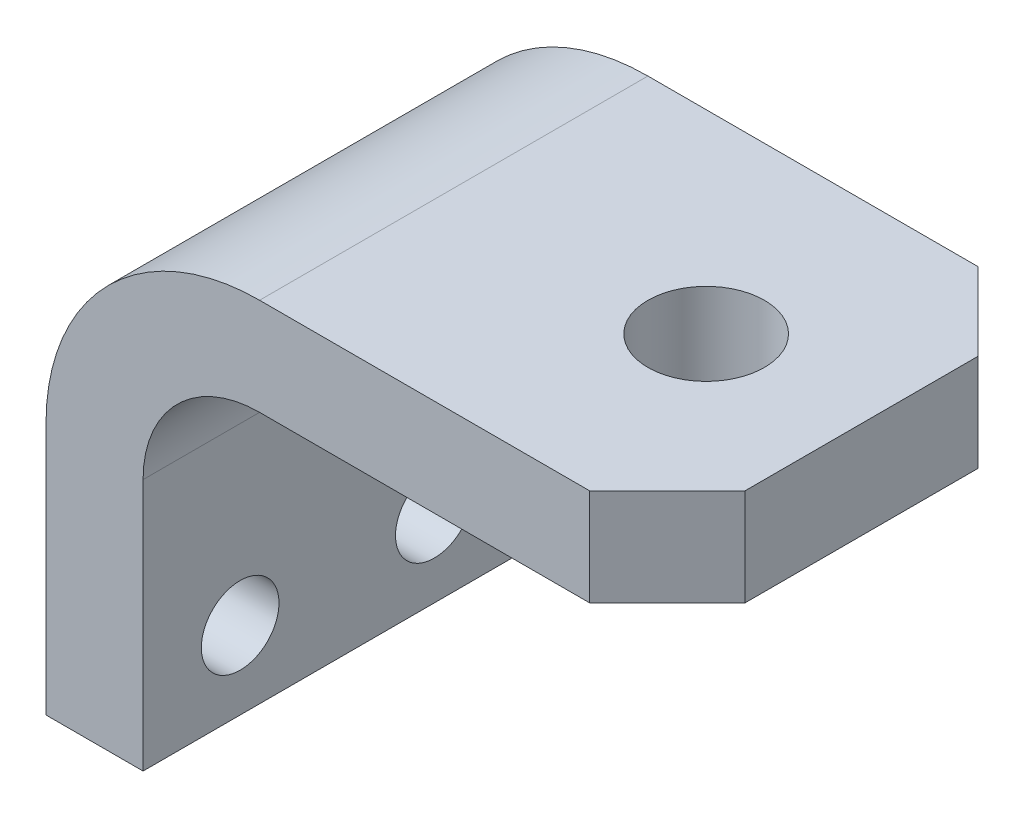
ISO-10303-21;
HEADER;
FILE_DESCRIPTION(('STEP AP214'),'2;1');
FILE_NAME('part.step','',(''),(''),'','','');
FILE_SCHEMA(('AUTOMOTIVE_DESIGN { 1 0 10303 214 1 1 1 1 }'));
ENDSEC;
DATA;
#1=APPLICATION_CONTEXT('core data for automotive mechanical design processes');
#2=APPLICATION_PROTOCOL_DEFINITION('international standard','automotive_design',2000,#1);
#3=PRODUCT_CONTEXT('',#1,'mechanical');
#4=PRODUCT('Part','Part','',(#3));
#5=PRODUCT_RELATED_PRODUCT_CATEGORY('part','',(#4));
#6=PRODUCT_DEFINITION_FORMATION('','',#4);
#7=PRODUCT_DEFINITION_CONTEXT('part definition',#1,'design');
#8=PRODUCT_DEFINITION('design','',#6,#7);
#9=PRODUCT_DEFINITION_SHAPE('','',#8);
#10=(LENGTH_UNIT() NAMED_UNIT(*) SI_UNIT(.MILLI.,.METRE.));
#11=(NAMED_UNIT(*) PLANE_ANGLE_UNIT() SI_UNIT($,.RADIAN.));
#12=(NAMED_UNIT(*) SI_UNIT($,.STERADIAN.) SOLID_ANGLE_UNIT());
#13=UNCERTAINTY_MEASURE_WITH_UNIT(LENGTH_MEASURE(1.E-05),#10,'distance_accuracy_value','');
#14=(GEOMETRIC_REPRESENTATION_CONTEXT(3) GLOBAL_UNCERTAINTY_ASSIGNED_CONTEXT((#13)) GLOBAL_UNIT_ASSIGNED_CONTEXT((#10,
#11,#12)) REPRESENTATION_CONTEXT('',''));
#15=CARTESIAN_POINT('',(0.,0.,0.));
#16=DIRECTION('',(0.,0.,1.));
#17=DIRECTION('',(1.,0.,0.));
#18=AXIS2_PLACEMENT_3D('',#15,#16,#17);
#19=CARTESIAN_POINT('',(25.4,0.,31.75));
#20=DIRECTION('',(-1.,0.,0.));
#21=DIRECTION('',(0.,-1.,0.));
#22=AXIS2_PLACEMENT_3D('',#19,#20,#21);
#23=PLANE('',#22);
#24=DIRECTION('',(0.,0.,-1.));
#25=VECTOR('',#24,1.);
#26=CARTESIAN_POINT('',(25.4,15.875,31.75));
#27=LINE('',#26,#25);
#28=CARTESIAN_POINT('',(25.4,15.875,19.0500000000001));
#29=VERTEX_POINT('',#28);
#30=CARTESIAN_POINT('',(25.4,15.875,-19.0500000000001));
#31=VERTEX_POINT('',#30);
#32=EDGE_CURVE('E120',#29,#31,#27,.T.);
#33=ORIENTED_EDGE('',*,*,#32,.F.);
#34=DIRECTION('',(0.,1.,0.));
#35=VECTOR('',#34,1.);
#36=CARTESIAN_POINT('',(25.4,-60.325,19.0500000000001));
#37=LINE('',#36,#35);
#38=CARTESIAN_POINT('',(25.4,0.,19.0500000000001));
#39=VERTEX_POINT('',#38);
#40=EDGE_CURVE('E108',#39,#29,#37,.T.);
#41=ORIENTED_EDGE('',*,*,#40,.F.);
#42=DIRECTION('',(0.,0.,-1.));
#43=VECTOR('',#42,1.);
#44=CARTESIAN_POINT('',(25.4,0.,31.75));
#45=LINE('',#44,#43);
#46=CARTESIAN_POINT('',(25.4,0.,-19.0500000000001));
#47=VERTEX_POINT('',#46);
#48=EDGE_CURVE('E164',#39,#47,#45,.T.);
#49=ORIENTED_EDGE('',*,*,#48,.T.);
#50=DIRECTION('',(0.,1.,0.));
#51=VECTOR('',#50,1.);
#52=CARTESIAN_POINT('',(25.4,-60.325,-19.0500000000001));
#53=LINE('',#52,#51);
#54=EDGE_CURVE('E127',#47,#31,#53,.T.);
#55=ORIENTED_EDGE('',*,*,#54,.T.);
#56=EDGE_LOOP('',(#33,#41,#49,#55));
#57=FACE_BOUND('',#56,.T.);
#58=ADVANCED_FACE('F34',(#57),#23,.F.);
#59=CARTESIAN_POINT('',(25.4,15.875,31.75));
#60=DIRECTION('',(0.,-1.,0.));
#61=DIRECTION('',(1.,0.,0.));
#62=AXIS2_PLACEMENT_3D('',#59,#60,#61);
#63=PLANE('',#62);
#64=CARTESIAN_POINT('',(0.,15.875,0.));
#65=DIRECTION('',(0.,1.,0.));
#66=DIRECTION('',(-1.,0.,0.));
#67=AXIS2_PLACEMENT_3D('',#64,#65,#66);
#68=CIRCLE('',#67,9.525);
#69=CARTESIAN_POINT('',(-9.525,15.875,0.));
#70=VERTEX_POINT('',#69);
#71=EDGE_CURVE('E138',#70,#70,#68,.T.);
#72=ORIENTED_EDGE('',*,*,#71,.F.);
#73=EDGE_LOOP('',(#72));
#74=FACE_BOUND('',#73,.T.);
#75=DIRECTION('',(-1.,0.,0.));
#76=VECTOR('',#75,1.);
#77=CARTESIAN_POINT('',(25.4,15.875,31.75));
#78=LINE('',#77,#76);
#79=CARTESIAN_POINT('',(12.7,15.875,31.75));
#80=VERTEX_POINT('',#79);
#81=CARTESIAN_POINT('',(-41.275,15.875,31.75));
#82=VERTEX_POINT('',#81);
#83=EDGE_CURVE('E123',#80,#82,#78,.T.);
#84=ORIENTED_EDGE('',*,*,#83,.F.);
#85=DIRECTION('',(-0.707106781186551,0.,0.707106781186544));
#86=VECTOR('',#85,1.);
#87=CARTESIAN_POINT('',(12.7,15.875,31.75));
#88=LINE('',#87,#86);
#89=EDGE_CURVE('E47',#29,#80,#88,.T.);
#90=ORIENTED_EDGE('',*,*,#89,.F.);
#91=ORIENTED_EDGE('',*,*,#32,.T.);
#92=DIRECTION('',(0.707106781186551,0.,0.707106781186544));
#93=VECTOR('',#92,1.);
#94=CARTESIAN_POINT('',(12.7,15.875,-31.75));
#95=LINE('',#94,#93);
#96=CARTESIAN_POINT('',(12.7,15.875,-31.75));
#97=VERTEX_POINT('',#96);
#98=EDGE_CURVE('E218',#97,#31,#95,.T.);
#99=ORIENTED_EDGE('',*,*,#98,.F.);
#100=DIRECTION('',(-1.,0.,0.));
#101=VECTOR('',#100,1.);
#102=CARTESIAN_POINT('',(25.4,15.875,-31.75));
#103=LINE('',#102,#101);
#104=CARTESIAN_POINT('',(-41.275,15.875,-31.75));
#105=VERTEX_POINT('',#104);
#106=EDGE_CURVE('E137',#97,#105,#103,.T.);
#107=ORIENTED_EDGE('',*,*,#106,.T.);
#108=DIRECTION('',(0.,0.,-1.));
#109=VECTOR('',#108,1.);
#110=CARTESIAN_POINT('',(-41.275,15.875,31.75));
#111=LINE('',#110,#109);
#112=EDGE_CURVE('E128',#82,#105,#111,.T.);
#113=ORIENTED_EDGE('',*,*,#112,.F.);
#114=EDGE_LOOP('',(#84,#90,#91,#99,#107,#113));
#115=FACE_BOUND('',#114,.T.);
#116=ADVANCED_FACE('F118',(#74,#115),#63,.F.);
#117=CARTESIAN_POINT('',(-41.275,-19.05,31.75));
#118=DIRECTION('',(0.,0.,-1.));
#119=DIRECTION('',(-1.,0.,0.));
#120=AXIS2_PLACEMENT_3D('',#117,#118,#119);
#121=CYLINDRICAL_SURFACE('',#120,34.925);
#122=CARTESIAN_POINT('',(-41.275,-19.05,-31.75));
#123=DIRECTION('',(0.,0.,1.));
#124=DIRECTION('',(1.,0.,0.));
#125=AXIS2_PLACEMENT_3D('',#122,#123,#124);
#126=CIRCLE('',#125,34.925);
#127=CARTESIAN_POINT('',(-76.2,-19.05,-31.75));
#128=VERTEX_POINT('',#127);
#129=EDGE_CURVE('E141',#105,#128,#126,.T.);
#130=ORIENTED_EDGE('',*,*,#129,.T.);
#131=DIRECTION('',(0.,0.,-1.));
#132=VECTOR('',#131,1.);
#133=CARTESIAN_POINT('',(-76.2,-19.05,31.75));
#134=LINE('',#133,#132);
#135=CARTESIAN_POINT('',(-76.2,-19.05,31.75));
#136=VERTEX_POINT('',#135);
#137=EDGE_CURVE('E131',#136,#128,#134,.T.);
#138=ORIENTED_EDGE('',*,*,#137,.F.);
#139=CARTESIAN_POINT('',(-41.275,-19.05,31.75));
#140=DIRECTION('',(0.,0.,1.));
#141=DIRECTION('',(1.,0.,0.));
#142=AXIS2_PLACEMENT_3D('',#139,#140,#141);
#143=CIRCLE('',#142,34.925);
#144=EDGE_CURVE('E151',#82,#136,#143,.T.);
#145=ORIENTED_EDGE('',*,*,#144,.F.);
#146=ORIENTED_EDGE('',*,*,#112,.T.);
#147=EDGE_LOOP('',(#130,#138,#145,#146));
#148=FACE_BOUND('',#147,.T.);
#149=ADVANCED_FACE('F217',(#148),#121,.T.);
#150=CARTESIAN_POINT('',(-76.2,-60.325,31.75));
#151=DIRECTION('',(1.,0.,0.));
#152=DIRECTION('',(0.,0.,-1.));
#153=AXIS2_PLACEMENT_3D('',#150,#151,#152);
#154=PLANE('',#153);
#155=CARTESIAN_POINT('',(-76.2,-47.625,-15.875));
#156=DIRECTION('',(1.,0.,0.));
#157=DIRECTION('',(0.,0.,-1.));
#158=AXIS2_PLACEMENT_3D('',#155,#156,#157);
#159=CIRCLE('',#158,6.35);
#160=CARTESIAN_POINT('',(-76.2,-47.625,-22.225));
#161=VERTEX_POINT('',#160);
#162=EDGE_CURVE('E359',#161,#161,#159,.F.);
#163=ORIENTED_EDGE('',*,*,#162,.F.);
#164=EDGE_LOOP('',(#163));
#165=FACE_BOUND('',#164,.T.);
#166=CARTESIAN_POINT('',(-76.2,-47.625,15.875));
#167=DIRECTION('',(1.,0.,0.));
#168=DIRECTION('',(0.,0.,-1.));
#169=AXIS2_PLACEMENT_3D('',#166,#167,#168);
#170=CIRCLE('',#169,6.35);
#171=CARTESIAN_POINT('',(-76.2,-47.625,9.525));
#172=VERTEX_POINT('',#171);
#173=EDGE_CURVE('E124',#172,#172,#170,.F.);
#174=ORIENTED_EDGE('',*,*,#173,.F.);
#175=EDGE_LOOP('',(#174));
#176=FACE_BOUND('',#175,.T.);
#177=DIRECTION('',(0.,-1.,0.));
#178=VECTOR('',#177,1.);
#179=CARTESIAN_POINT('',(-76.2,-60.325,-31.75));
#180=LINE('',#179,#178);
#181=CARTESIAN_POINT('',(-76.2,-60.325,-31.75));
#182=VERTEX_POINT('',#181);
#183=EDGE_CURVE('E167',#128,#182,#180,.T.);
#184=ORIENTED_EDGE('',*,*,#183,.T.);
#185=DIRECTION('',(0.,0.,-1.));
#186=VECTOR('',#185,1.);
#187=CARTESIAN_POINT('',(-76.2,-60.325,31.75));
#188=LINE('',#187,#186);
#189=CARTESIAN_POINT('',(-76.2,-60.325,31.75));
#190=VERTEX_POINT('',#189);
#191=EDGE_CURVE('E187',#190,#182,#188,.T.);
#192=ORIENTED_EDGE('',*,*,#191,.F.);
#193=DIRECTION('',(0.,-1.,0.));
#194=VECTOR('',#193,1.);
#195=CARTESIAN_POINT('',(-76.2,-60.325,31.75));
#196=LINE('',#195,#194);
#197=EDGE_CURVE('E154',#136,#190,#196,.T.);
#198=ORIENTED_EDGE('',*,*,#197,.F.);
#199=ORIENTED_EDGE('',*,*,#137,.T.);
#200=EDGE_LOOP('',(#184,#192,#198,#199));
#201=FACE_BOUND('',#200,.T.);
#202=ADVANCED_FACE('F194',(#165,#176,#201),#154,.F.);
#203=CARTESIAN_POINT('',(-76.2,-60.325,31.75));
#204=DIRECTION('',(0.,1.,0.));
#205=DIRECTION('',(0.,0.,1.));
#206=AXIS2_PLACEMENT_3D('',#203,#204,#205);
#207=PLANE('',#206);
#208=DIRECTION('',(1.,0.,0.));
#209=VECTOR('',#208,1.);
#210=CARTESIAN_POINT('',(-76.2,-60.325,-31.75));
#211=LINE('',#210,#209);
#212=CARTESIAN_POINT('',(-60.325,-60.325,-31.75));
#213=VERTEX_POINT('',#212);
#214=EDGE_CURVE('E169',#182,#213,#211,.T.);
#215=ORIENTED_EDGE('',*,*,#214,.T.);
#216=DIRECTION('',(0.,0.,-1.));
#217=VECTOR('',#216,1.);
#218=CARTESIAN_POINT('',(-60.325,-60.325,31.75));
#219=LINE('',#218,#217);
#220=CARTESIAN_POINT('',(-60.325,-60.325,31.75));
#221=VERTEX_POINT('',#220);
#222=EDGE_CURVE('E184',#221,#213,#219,.T.);
#223=ORIENTED_EDGE('',*,*,#222,.F.);
#224=DIRECTION('',(1.,0.,0.));
#225=VECTOR('',#224,1.);
#226=CARTESIAN_POINT('',(-76.2,-60.325,31.75));
#227=LINE('',#226,#225);
#228=EDGE_CURVE('E156',#190,#221,#227,.T.);
#229=ORIENTED_EDGE('',*,*,#228,.F.);
#230=ORIENTED_EDGE('',*,*,#191,.T.);
#231=EDGE_LOOP('',(#215,#223,#229,#230));
#232=FACE_BOUND('',#231,.T.);
#233=ADVANCED_FACE('F207',(#232),#207,.F.);
#234=CARTESIAN_POINT('',(-60.325,-60.325,31.75));
#235=DIRECTION('',(-1.,0.,0.));
#236=DIRECTION('',(0.,-1.,0.));
#237=AXIS2_PLACEMENT_3D('',#234,#235,#236);
#238=PLANE('',#237);
#239=CARTESIAN_POINT('',(-60.325,-47.625,-15.875));
#240=DIRECTION('',(1.,0.,0.));
#241=DIRECTION('',(0.,1.,0.));
#242=AXIS2_PLACEMENT_3D('',#239,#240,#241);
#243=CIRCLE('',#242,6.35);
#244=CARTESIAN_POINT('',(-60.325,-41.275,-15.875));
#245=VERTEX_POINT('',#244);
#246=EDGE_CURVE('E356',#245,#245,#243,.T.);
#247=ORIENTED_EDGE('',*,*,#246,.F.);
#248=EDGE_LOOP('',(#247));
#249=FACE_BOUND('',#248,.T.);
#250=CARTESIAN_POINT('',(-60.325,-47.625,15.875));
#251=DIRECTION('',(1.,0.,0.));
#252=DIRECTION('',(0.,1.,0.));
#253=AXIS2_PLACEMENT_3D('',#250,#251,#252);
#254=CIRCLE('',#253,6.35);
#255=CARTESIAN_POINT('',(-60.325,-41.275,15.875));
#256=VERTEX_POINT('',#255);
#257=EDGE_CURVE('E360',#256,#256,#254,.T.);
#258=ORIENTED_EDGE('',*,*,#257,.F.);
#259=EDGE_LOOP('',(#258));
#260=FACE_BOUND('',#259,.T.);
#261=DIRECTION('',(0.,1.,0.));
#262=VECTOR('',#261,1.);
#263=CARTESIAN_POINT('',(-60.325,-60.325,-31.75));
#264=LINE('',#263,#262);
#265=CARTESIAN_POINT('',(-60.325,-19.05,-31.75));
#266=VERTEX_POINT('',#265);
#267=EDGE_CURVE('E171',#213,#266,#264,.T.);
#268=ORIENTED_EDGE('',*,*,#267,.T.);
#269=DIRECTION('',(0.,0.,-1.));
#270=VECTOR('',#269,1.);
#271=CARTESIAN_POINT('',(-60.325,-19.05,31.75));
#272=LINE('',#271,#270);
#273=CARTESIAN_POINT('',(-60.325,-19.05,31.75));
#274=VERTEX_POINT('',#273);
#275=EDGE_CURVE('E181',#274,#266,#272,.T.);
#276=ORIENTED_EDGE('',*,*,#275,.F.);
#277=DIRECTION('',(0.,1.,0.));
#278=VECTOR('',#277,1.);
#279=CARTESIAN_POINT('',(-60.325,-60.325,31.75));
#280=LINE('',#279,#278);
#281=EDGE_CURVE('E158',#221,#274,#280,.T.);
#282=ORIENTED_EDGE('',*,*,#281,.F.);
#283=ORIENTED_EDGE('',*,*,#222,.T.);
#284=EDGE_LOOP('',(#268,#276,#282,#283));
#285=FACE_BOUND('',#284,.T.);
#286=ADVANCED_FACE('F211',(#249,#260,#285),#238,.F.);
#287=CARTESIAN_POINT('',(-41.275,-19.05,31.75));
#288=DIRECTION('',(0.,0.,-1.));
#289=DIRECTION('',(-1.,0.,0.));
#290=AXIS2_PLACEMENT_3D('',#287,#288,#289);
#291=CYLINDRICAL_SURFACE('',#290,19.05);
#292=CARTESIAN_POINT('',(-41.275,-19.05,-31.75));
#293=DIRECTION('',(0.,0.,-1.));
#294=DIRECTION('',(1.,0.,0.));
#295=AXIS2_PLACEMENT_3D('',#292,#293,#294);
#296=CIRCLE('',#295,19.05);
#297=CARTESIAN_POINT('',(-41.275,0.,-31.75));
#298=VERTEX_POINT('',#297);
#299=EDGE_CURVE('E173',#266,#298,#296,.T.);
#300=ORIENTED_EDGE('',*,*,#299,.T.);
#301=DIRECTION('',(0.,0.,-1.));
#302=VECTOR('',#301,1.);
#303=CARTESIAN_POINT('',(-41.275,0.,31.75));
#304=LINE('',#303,#302);
#305=CARTESIAN_POINT('',(-41.275,0.,31.75));
#306=VERTEX_POINT('',#305);
#307=EDGE_CURVE('E178',#306,#298,#304,.T.);
#308=ORIENTED_EDGE('',*,*,#307,.F.);
#309=CARTESIAN_POINT('',(-41.275,-19.05,31.75));
#310=DIRECTION('',(0.,0.,-1.));
#311=DIRECTION('',(1.,0.,0.));
#312=AXIS2_PLACEMENT_3D('',#309,#310,#311);
#313=CIRCLE('',#312,19.05);
#314=EDGE_CURVE('E160',#274,#306,#313,.T.);
#315=ORIENTED_EDGE('',*,*,#314,.F.);
#316=ORIENTED_EDGE('',*,*,#275,.T.);
#317=EDGE_LOOP('',(#300,#308,#315,#316));
#318=FACE_BOUND('',#317,.T.);
#319=ADVANCED_FACE('F224',(#318),#291,.F.);
#320=CARTESIAN_POINT('',(25.4,0.,31.75));
#321=DIRECTION('',(0.,1.,0.));
#322=DIRECTION('',(-1.,0.,0.));
#323=AXIS2_PLACEMENT_3D('',#320,#321,#322);
#324=PLANE('',#323);
#325=CARTESIAN_POINT('',(0.,0.,0.));
#326=DIRECTION('',(0.,1.,0.));
#327=DIRECTION('',(-1.,0.,0.));
#328=AXIS2_PLACEMENT_3D('',#325,#326,#327);
#329=CIRCLE('',#328,9.525);
#330=CARTESIAN_POINT('',(-9.525,0.,0.));
#331=VERTEX_POINT('',#330);
#332=EDGE_CURVE('E135',#331,#331,#329,.T.);
#333=ORIENTED_EDGE('',*,*,#332,.T.);
#334=EDGE_LOOP('',(#333));
#335=FACE_BOUND('',#334,.T.);
#336=ORIENTED_EDGE('',*,*,#48,.F.);
#337=DIRECTION('',(-0.707106781186551,0.,0.707106781186544));
#338=VECTOR('',#337,1.);
#339=CARTESIAN_POINT('',(19.0500000000001,0.,25.4));
#340=LINE('',#339,#338);
#341=CARTESIAN_POINT('',(12.7,0.,31.75));
#342=VERTEX_POINT('',#341);
#343=EDGE_CURVE('E111',#39,#342,#340,.T.);
#344=ORIENTED_EDGE('',*,*,#343,.T.);
#345=DIRECTION('',(1.,0.,0.));
#346=VECTOR('',#345,1.);
#347=CARTESIAN_POINT('',(25.4,0.,31.75));
#348=LINE('',#347,#346);
#349=EDGE_CURVE('E162',#306,#342,#348,.T.);
#350=ORIENTED_EDGE('',*,*,#349,.F.);
#351=ORIENTED_EDGE('',*,*,#307,.T.);
#352=DIRECTION('',(1.,0.,0.));
#353=VECTOR('',#352,1.);
#354=CARTESIAN_POINT('',(25.4,0.,-31.75));
#355=LINE('',#354,#353);
#356=CARTESIAN_POINT('',(12.7,0.,-31.75));
#357=VERTEX_POINT('',#356);
#358=EDGE_CURVE('E152',#298,#357,#355,.T.);
#359=ORIENTED_EDGE('',*,*,#358,.T.);
#360=DIRECTION('',(0.707106781186551,0.,0.707106781186544));
#361=VECTOR('',#360,1.);
#362=CARTESIAN_POINT('',(50.8000000000001,0.,6.34999999999966));
#363=LINE('',#362,#361);
#364=EDGE_CURVE('E55',#357,#47,#363,.T.);
#365=ORIENTED_EDGE('',*,*,#364,.T.);
#366=EDGE_LOOP('',(#336,#344,#350,#351,#359,#365));
#367=FACE_BOUND('',#366,.T.);
#368=ADVANCED_FACE('F221',(#335,#367),#324,.F.);
#369=CARTESIAN_POINT('',(-41.275,-19.05,31.75));
#370=DIRECTION('',(0.,0.,1.));
#371=DIRECTION('',(1.,0.,0.));
#372=AXIS2_PLACEMENT_3D('',#369,#370,#371);
#373=PLANE('',#372);
#374=DIRECTION('',(0.,-1.,0.));
#375=VECTOR('',#374,1.);
#376=CARTESIAN_POINT('',(12.7,-19.05,31.75));
#377=LINE('',#376,#375);
#378=EDGE_CURVE('E11',#80,#342,#377,.T.);
#379=ORIENTED_EDGE('',*,*,#378,.F.);
#380=ORIENTED_EDGE('',*,*,#83,.T.);
#381=ORIENTED_EDGE('',*,*,#144,.T.);
#382=ORIENTED_EDGE('',*,*,#197,.T.);
#383=ORIENTED_EDGE('',*,*,#228,.T.);
#384=ORIENTED_EDGE('',*,*,#281,.T.);
#385=ORIENTED_EDGE('',*,*,#314,.T.);
#386=ORIENTED_EDGE('',*,*,#349,.T.);
#387=EDGE_LOOP('',(#379,#380,#381,#382,#383,#384,#385,#386));
#388=FACE_BOUND('',#387,.T.);
#389=ADVANCED_FACE('F215',(#388),#373,.T.);
#390=CARTESIAN_POINT('',(-41.275,-19.05,-31.75));
#391=DIRECTION('',(0.,0.,1.));
#392=DIRECTION('',(1.,0.,0.));
#393=AXIS2_PLACEMENT_3D('',#390,#391,#392);
#394=PLANE('',#393);
#395=ORIENTED_EDGE('',*,*,#106,.F.);
#396=DIRECTION('',(0.,-1.,0.));
#397=VECTOR('',#396,1.);
#398=CARTESIAN_POINT('',(12.7,-19.05,-31.75));
#399=LINE('',#398,#397);
#400=EDGE_CURVE('E41',#97,#357,#399,.T.);
#401=ORIENTED_EDGE('',*,*,#400,.T.);
#402=ORIENTED_EDGE('',*,*,#358,.F.);
#403=ORIENTED_EDGE('',*,*,#299,.F.);
#404=ORIENTED_EDGE('',*,*,#267,.F.);
#405=ORIENTED_EDGE('',*,*,#214,.F.);
#406=ORIENTED_EDGE('',*,*,#183,.F.);
#407=ORIENTED_EDGE('',*,*,#129,.F.);
#408=EDGE_LOOP('',(#395,#401,#402,#403,#404,#405,#406,#407));
#409=FACE_BOUND('',#408,.T.);
#410=ADVANCED_FACE('F202',(#409),#394,.F.);
#411=CARTESIAN_POINT('',(0.,-60.325,0.));
#412=DIRECTION('',(0.,1.,0.));
#413=DIRECTION('',(-1.,0.,0.));
#414=AXIS2_PLACEMENT_3D('',#411,#412,#413);
#415=CYLINDRICAL_SURFACE('',#414,9.525);
#416=ORIENTED_EDGE('',*,*,#71,.T.);
#417=EDGE_LOOP('',(#416));
#418=FACE_BOUND('',#417,.T.);
#419=ORIENTED_EDGE('',*,*,#332,.F.);
#420=EDGE_LOOP('',(#419));
#421=FACE_BOUND('',#420,.T.);
#422=ADVANCED_FACE('F294',(#418,#421),#415,.F.);
#423=CARTESIAN_POINT('',(12.7,-60.325,-31.75));
#424=DIRECTION('',(-0.707106781186544,0.,0.707106781186551));
#425=DIRECTION('',(0.707106781186551,0.,0.707106781186544));
#426=AXIS2_PLACEMENT_3D('',#423,#424,#425);
#427=PLANE('',#426);
#428=ORIENTED_EDGE('',*,*,#400,.F.);
#429=ORIENTED_EDGE('',*,*,#98,.T.);
#430=ORIENTED_EDGE('',*,*,#54,.F.);
#431=ORIENTED_EDGE('',*,*,#364,.F.);
#432=EDGE_LOOP('',(#428,#429,#430,#431));
#433=FACE_BOUND('',#432,.T.);
#434=ADVANCED_FACE('F291',(#433),#427,.F.);
#435=CARTESIAN_POINT('',(12.7,-60.325,31.75));
#436=DIRECTION('',(-0.707106781186544,0.,-0.707106781186551));
#437=DIRECTION('',(-0.707106781186551,0.,0.707106781186544));
#438=AXIS2_PLACEMENT_3D('',#435,#436,#437);
#439=PLANE('',#438);
#440=ORIENTED_EDGE('',*,*,#40,.T.);
#441=ORIENTED_EDGE('',*,*,#89,.T.);
#442=ORIENTED_EDGE('',*,*,#378,.T.);
#443=ORIENTED_EDGE('',*,*,#343,.F.);
#444=EDGE_LOOP('',(#440,#441,#442,#443));
#445=FACE_BOUND('',#444,.T.);
#446=ADVANCED_FACE('F109',(#445),#439,.F.);
#447=CARTESIAN_POINT('',(-76.201,-47.625,15.875));
#448=DIRECTION('',(1.,0.,0.));
#449=DIRECTION('',(0.,1.,0.));
#450=AXIS2_PLACEMENT_3D('',#447,#448,#449);
#451=CYLINDRICAL_SURFACE('',#450,6.35);
#452=ORIENTED_EDGE('',*,*,#257,.T.);
#453=EDGE_LOOP('',(#452));
#454=FACE_BOUND('',#453,.T.);
#455=ORIENTED_EDGE('',*,*,#173,.T.);
#456=EDGE_LOOP('',(#455));
#457=FACE_BOUND('',#456,.T.);
#458=ADVANCED_FACE('F266',(#454,#457),#451,.F.);
#459=CARTESIAN_POINT('',(-76.201,-47.625,-15.875));
#460=DIRECTION('',(1.,0.,0.));
#461=DIRECTION('',(0.,1.,0.));
#462=AXIS2_PLACEMENT_3D('',#459,#460,#461);
#463=CYLINDRICAL_SURFACE('',#462,6.35);
#464=ORIENTED_EDGE('',*,*,#246,.T.);
#465=EDGE_LOOP('',(#464));
#466=FACE_BOUND('',#465,.T.);
#467=ORIENTED_EDGE('',*,*,#162,.T.);
#468=EDGE_LOOP('',(#467));
#469=FACE_BOUND('',#468,.T.);
#470=ADVANCED_FACE('F271',(#466,#469),#463,.F.);
#471=CLOSED_SHELL('',(#58,#116,#149,#202,#233,#286,#319,#368,#389,#410,#422,#434,#446,#458,#470));
#472=MANIFOLD_SOLID_BREP('B2',#471);
#473=ADVANCED_BREP_SHAPE_REPRESENTATION('',(#18,#472),#14);
#474=SHAPE_DEFINITION_REPRESENTATION(#9,#473);
ENDSEC;
END-ISO-10303-21;
